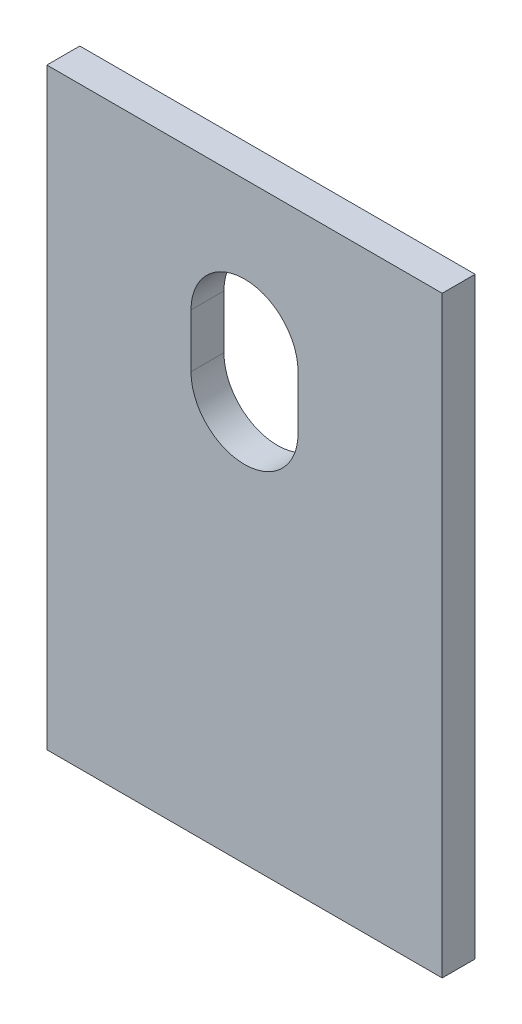
ISO-10303-21;
HEADER;
FILE_DESCRIPTION(('STEP AP214'),'2;1');
FILE_NAME('part.step','',(''),(''),'','','');
FILE_SCHEMA(('AUTOMOTIVE_DESIGN { 1 0 10303 214 1 1 1 1 }'));
ENDSEC;
DATA;
#1=APPLICATION_CONTEXT('core data for automotive mechanical design processes');
#2=APPLICATION_PROTOCOL_DEFINITION('international standard','automotive_design',2000,#1);
#3=PRODUCT_CONTEXT('',#1,'mechanical');
#4=PRODUCT('Part','Part','',(#3));
#5=PRODUCT_RELATED_PRODUCT_CATEGORY('part','',(#4));
#6=PRODUCT_DEFINITION_FORMATION('','',#4);
#7=PRODUCT_DEFINITION_CONTEXT('part definition',#1,'design');
#8=PRODUCT_DEFINITION('design','',#6,#7);
#9=PRODUCT_DEFINITION_SHAPE('','',#8);
#10=(LENGTH_UNIT() NAMED_UNIT(*) SI_UNIT(.MILLI.,.METRE.));
#11=(NAMED_UNIT(*) PLANE_ANGLE_UNIT() SI_UNIT($,.RADIAN.));
#12=(NAMED_UNIT(*) SI_UNIT($,.STERADIAN.) SOLID_ANGLE_UNIT());
#13=UNCERTAINTY_MEASURE_WITH_UNIT(LENGTH_MEASURE(1.E-05),#10,'distance_accuracy_value','');
#14=(GEOMETRIC_REPRESENTATION_CONTEXT(3) GLOBAL_UNCERTAINTY_ASSIGNED_CONTEXT((#13)) GLOBAL_UNIT_ASSIGNED_CONTEXT((#10,
#11,#12)) REPRESENTATION_CONTEXT('',''));
#15=CARTESIAN_POINT('',(0.,0.,0.));
#16=DIRECTION('',(0.,0.,1.));
#17=DIRECTION('',(1.,0.,0.));
#18=AXIS2_PLACEMENT_3D('',#15,#16,#17);
#19=CARTESIAN_POINT('',(0.,114.3,0.));
#20=DIRECTION('',(1.,0.,0.));
#21=DIRECTION('',(0.,0.,-1.));
#22=AXIS2_PLACEMENT_3D('',#19,#20,#21);
#23=PLANE('',#22);
#24=DIRECTION('',(0.,0.,1.));
#25=VECTOR('',#24,1.);
#26=CARTESIAN_POINT('',(0.,0.,0.));
#27=LINE('',#26,#25);
#28=CARTESIAN_POINT('',(0.,0.,-6.35));
#29=VERTEX_POINT('',#28);
#30=CARTESIAN_POINT('',(0.,0.,0.));
#31=VERTEX_POINT('',#30);
#32=EDGE_CURVE('E132',#29,#31,#27,.T.);
#33=ORIENTED_EDGE('',*,*,#32,.T.);
#34=DIRECTION('',(0.,-1.,0.));
#35=VECTOR('',#34,1.);
#36=CARTESIAN_POINT('',(0.,114.3,0.));
#37=LINE('',#36,#35);
#38=CARTESIAN_POINT('',(0.,114.3,0.));
#39=VERTEX_POINT('',#38);
#40=EDGE_CURVE('E11',#39,#31,#37,.T.);
#41=ORIENTED_EDGE('',*,*,#40,.F.);
#42=DIRECTION('',(0.,0.,1.));
#43=VECTOR('',#42,1.);
#44=CARTESIAN_POINT('',(0.,114.3,0.));
#45=LINE('',#44,#43);
#46=CARTESIAN_POINT('',(0.,114.3,-6.35));
#47=VERTEX_POINT('',#46);
#48=EDGE_CURVE('E136',#47,#39,#45,.T.);
#49=ORIENTED_EDGE('',*,*,#48,.F.);
#50=DIRECTION('',(0.,-1.,0.));
#51=VECTOR('',#50,1.);
#52=CARTESIAN_POINT('',(0.,114.3,-6.35));
#53=LINE('',#52,#51);
#54=EDGE_CURVE('E146',#47,#29,#53,.T.);
#55=ORIENTED_EDGE('',*,*,#54,.T.);
#56=EDGE_LOOP('',(#33,#41,#49,#55));
#57=FACE_BOUND('',#56,.T.);
#58=ADVANCED_FACE('F35',(#57),#23,.F.);
#59=CARTESIAN_POINT('',(0.,114.3,0.));
#60=DIRECTION('',(0.,0.,-1.));
#61=DIRECTION('',(-1.,0.,0.));
#62=AXIS2_PLACEMENT_3D('',#59,#60,#61);
#63=PLANE('',#62);
#64=DIRECTION('',(0.,-1.,0.));
#65=VECTOR('',#64,1.);
#66=CARTESIAN_POINT('',(27.78125,87.3125,0.));
#67=LINE('',#66,#65);
#68=CARTESIAN_POINT('',(27.78125,87.3125,0.));
#69=VERTEX_POINT('',#68);
#70=CARTESIAN_POINT('',(27.78125,76.99375,0.));
#71=VERTEX_POINT('',#70);
#72=EDGE_CURVE('E126',#69,#71,#67,.T.);
#73=ORIENTED_EDGE('',*,*,#72,.F.);
#74=CARTESIAN_POINT('',(38.1,87.3125,0.));
#75=DIRECTION('',(0.,0.,1.));
#76=DIRECTION('',(1.,0.,0.));
#77=AXIS2_PLACEMENT_3D('',#74,#75,#76);
#78=CIRCLE('',#77,10.31875);
#79=CARTESIAN_POINT('',(48.41875,87.3125,0.));
#80=VERTEX_POINT('',#79);
#81=EDGE_CURVE('E49',#80,#69,#78,.T.);
#82=ORIENTED_EDGE('',*,*,#81,.F.);
#83=DIRECTION('',(0.,1.,0.));
#84=VECTOR('',#83,1.);
#85=CARTESIAN_POINT('',(48.41875,87.3125,0.));
#86=LINE('',#85,#84);
#87=CARTESIAN_POINT('',(48.41875,76.99375,0.));
#88=VERTEX_POINT('',#87);
#89=EDGE_CURVE('E117',#88,#80,#86,.T.);
#90=ORIENTED_EDGE('',*,*,#89,.F.);
#91=CARTESIAN_POINT('',(38.1,76.99375,0.));
#92=DIRECTION('',(0.,0.,1.));
#93=DIRECTION('',(1.,0.,0.));
#94=AXIS2_PLACEMENT_3D('',#91,#92,#93);
#95=CIRCLE('',#94,10.31875);
#96=EDGE_CURVE('E120',#71,#88,#95,.T.);
#97=ORIENTED_EDGE('',*,*,#96,.F.);
#98=EDGE_LOOP('',(#73,#82,#90,#97));
#99=FACE_BOUND('',#98,.T.);
#100=DIRECTION('',(1.,0.,0.));
#101=VECTOR('',#100,1.);
#102=CARTESIAN_POINT('',(0.,0.,0.));
#103=LINE('',#102,#101);
#104=CARTESIAN_POINT('',(76.2,0.,0.));
#105=VERTEX_POINT('',#104);
#106=EDGE_CURVE('E149',#31,#105,#103,.T.);
#107=ORIENTED_EDGE('',*,*,#106,.T.);
#108=DIRECTION('',(0.,-1.,0.));
#109=VECTOR('',#108,1.);
#110=CARTESIAN_POINT('',(76.2,114.3,0.));
#111=LINE('',#110,#109);
#112=CARTESIAN_POINT('',(76.2,114.3,0.));
#113=VERTEX_POINT('',#112);
#114=EDGE_CURVE('E42',#113,#105,#111,.T.);
#115=ORIENTED_EDGE('',*,*,#114,.F.);
#116=DIRECTION('',(1.,0.,0.));
#117=VECTOR('',#116,1.);
#118=CARTESIAN_POINT('',(0.,114.3,0.));
#119=LINE('',#118,#117);
#120=EDGE_CURVE('E139',#39,#113,#119,.T.);
#121=ORIENTED_EDGE('',*,*,#120,.F.);
#122=ORIENTED_EDGE('',*,*,#40,.T.);
#123=EDGE_LOOP('',(#107,#115,#121,#122));
#124=FACE_BOUND('',#123,.T.);
#125=ADVANCED_FACE('F177',(#99,#124),#63,.F.);
#126=CARTESIAN_POINT('',(76.2,114.3,0.));
#127=DIRECTION('',(-1.,0.,0.));
#128=DIRECTION('',(0.,0.,1.));
#129=AXIS2_PLACEMENT_3D('',#126,#127,#128);
#130=PLANE('',#129);
#131=DIRECTION('',(0.,0.,-1.));
#132=VECTOR('',#131,1.);
#133=CARTESIAN_POINT('',(76.2,0.,0.));
#134=LINE('',#133,#132);
#135=CARTESIAN_POINT('',(76.2,0.,-6.35));
#136=VERTEX_POINT('',#135);
#137=EDGE_CURVE('E151',#105,#136,#134,.T.);
#138=ORIENTED_EDGE('',*,*,#137,.T.);
#139=DIRECTION('',(0.,-1.,0.));
#140=VECTOR('',#139,1.);
#141=CARTESIAN_POINT('',(76.2,114.3,-6.35));
#142=LINE('',#141,#140);
#143=CARTESIAN_POINT('',(76.2,114.3,-6.35));
#144=VERTEX_POINT('',#143);
#145=EDGE_CURVE('E156',#144,#136,#142,.T.);
#146=ORIENTED_EDGE('',*,*,#145,.F.);
#147=DIRECTION('',(0.,0.,-1.));
#148=VECTOR('',#147,1.);
#149=CARTESIAN_POINT('',(76.2,114.3,0.));
#150=LINE('',#149,#148);
#151=EDGE_CURVE('E142',#113,#144,#150,.T.);
#152=ORIENTED_EDGE('',*,*,#151,.F.);
#153=ORIENTED_EDGE('',*,*,#114,.T.);
#154=EDGE_LOOP('',(#138,#146,#152,#153));
#155=FACE_BOUND('',#154,.T.);
#156=ADVANCED_FACE('F163',(#155),#130,.F.);
#157=CARTESIAN_POINT('',(0.,114.3,-6.35));
#158=DIRECTION('',(0.,0.,1.));
#159=DIRECTION('',(1.,0.,0.));
#160=AXIS2_PLACEMENT_3D('',#157,#158,#159);
#161=PLANE('',#160);
#162=DIRECTION('',(0.,1.,0.));
#163=VECTOR('',#162,1.);
#164=CARTESIAN_POINT('',(48.41875,87.3125,-6.35));
#165=LINE('',#164,#163);
#166=CARTESIAN_POINT('',(48.41875,76.99375,-6.35));
#167=VERTEX_POINT('',#166);
#168=CARTESIAN_POINT('',(48.41875,87.3125,-6.35));
#169=VERTEX_POINT('',#168);
#170=EDGE_CURVE('E107',#167,#169,#165,.T.);
#171=ORIENTED_EDGE('',*,*,#170,.T.);
#172=CARTESIAN_POINT('',(38.1,87.3125,-6.35));
#173=DIRECTION('',(0.,0.,1.));
#174=DIRECTION('',(1.,0.,0.));
#175=AXIS2_PLACEMENT_3D('',#172,#173,#174);
#176=CIRCLE('',#175,10.31875);
#177=CARTESIAN_POINT('',(27.78125,87.3125,-6.35));
#178=VERTEX_POINT('',#177);
#179=EDGE_CURVE('E101',#169,#178,#176,.T.);
#180=ORIENTED_EDGE('',*,*,#179,.T.);
#181=DIRECTION('',(0.,-1.,0.));
#182=VECTOR('',#181,1.);
#183=CARTESIAN_POINT('',(27.78125,87.3125,-6.35));
#184=LINE('',#183,#182);
#185=CARTESIAN_POINT('',(27.78125,76.99375,-6.35));
#186=VERTEX_POINT('',#185);
#187=EDGE_CURVE('E110',#178,#186,#184,.T.);
#188=ORIENTED_EDGE('',*,*,#187,.T.);
#189=CARTESIAN_POINT('',(38.1,76.99375,-6.35));
#190=DIRECTION('',(0.,0.,1.));
#191=DIRECTION('',(1.,0.,0.));
#192=AXIS2_PLACEMENT_3D('',#189,#190,#191);
#193=CIRCLE('',#192,10.31875);
#194=EDGE_CURVE('E57',#186,#167,#193,.T.);
#195=ORIENTED_EDGE('',*,*,#194,.T.);
#196=EDGE_LOOP('',(#171,#180,#188,#195));
#197=FACE_BOUND('',#196,.T.);
#198=DIRECTION('',(-1.,0.,0.));
#199=VECTOR('',#198,1.);
#200=CARTESIAN_POINT('',(0.,0.,-6.35));
#201=LINE('',#200,#199);
#202=EDGE_CURVE('E140',#136,#29,#201,.T.);
#203=ORIENTED_EDGE('',*,*,#202,.T.);
#204=ORIENTED_EDGE('',*,*,#54,.F.);
#205=DIRECTION('',(-1.,0.,0.));
#206=VECTOR('',#205,1.);
#207=CARTESIAN_POINT('',(0.,114.3,-6.35));
#208=LINE('',#207,#206);
#209=EDGE_CURVE('E144',#144,#47,#208,.T.);
#210=ORIENTED_EDGE('',*,*,#209,.F.);
#211=ORIENTED_EDGE('',*,*,#145,.T.);
#212=EDGE_LOOP('',(#203,#204,#210,#211));
#213=FACE_BOUND('',#212,.T.);
#214=ADVANCED_FACE('F114',(#197,#213),#161,.F.);
#215=CARTESIAN_POINT('',(0.,114.3,0.));
#216=DIRECTION('',(0.,-1.,0.));
#217=DIRECTION('',(0.,0.,-1.));
#218=AXIS2_PLACEMENT_3D('',#215,#216,#217);
#219=PLANE('',#218);
#220=ORIENTED_EDGE('',*,*,#48,.T.);
#221=ORIENTED_EDGE('',*,*,#120,.T.);
#222=ORIENTED_EDGE('',*,*,#151,.T.);
#223=ORIENTED_EDGE('',*,*,#209,.T.);
#224=EDGE_LOOP('',(#220,#221,#222,#223));
#225=FACE_BOUND('',#224,.T.);
#226=ADVANCED_FACE('F176',(#225),#219,.F.);
#227=CARTESIAN_POINT('',(0.,0.,0.));
#228=DIRECTION('',(0.,-1.,0.));
#229=DIRECTION('',(0.,0.,-1.));
#230=AXIS2_PLACEMENT_3D('',#227,#228,#229);
#231=PLANE('',#230);
#232=ORIENTED_EDGE('',*,*,#32,.F.);
#233=ORIENTED_EDGE('',*,*,#202,.F.);
#234=ORIENTED_EDGE('',*,*,#137,.F.);
#235=ORIENTED_EDGE('',*,*,#106,.F.);
#236=EDGE_LOOP('',(#232,#233,#234,#235));
#237=FACE_BOUND('',#236,.T.);
#238=ADVANCED_FACE('F169',(#237),#231,.T.);
#239=CARTESIAN_POINT('',(38.1,87.3125,-6.35));
#240=DIRECTION('',(0.,0.,1.));
#241=DIRECTION('',(1.,0.,0.));
#242=AXIS2_PLACEMENT_3D('',#239,#240,#241);
#243=CYLINDRICAL_SURFACE('',#242,10.31875);
#244=ORIENTED_EDGE('',*,*,#81,.T.);
#245=DIRECTION('',(0.,0.,1.));
#246=VECTOR('',#245,1.);
#247=CARTESIAN_POINT('',(27.78125,87.3125,-6.35));
#248=LINE('',#247,#246);
#249=EDGE_CURVE('E97',#178,#69,#248,.T.);
#250=ORIENTED_EDGE('',*,*,#249,.F.);
#251=ORIENTED_EDGE('',*,*,#179,.F.);
#252=DIRECTION('',(0.,0.,1.));
#253=VECTOR('',#252,1.);
#254=CARTESIAN_POINT('',(48.41875,87.3125,-6.35));
#255=LINE('',#254,#253);
#256=EDGE_CURVE('E130',#169,#80,#255,.T.);
#257=ORIENTED_EDGE('',*,*,#256,.T.);
#258=EDGE_LOOP('',(#244,#250,#251,#257));
#259=FACE_BOUND('',#258,.T.);
#260=ADVANCED_FACE('F99',(#259),#243,.F.);
#261=CARTESIAN_POINT('',(48.41875,87.3125,-6.35));
#262=DIRECTION('',(1.,0.,0.));
#263=DIRECTION('',(0.,0.,-1.));
#264=AXIS2_PLACEMENT_3D('',#261,#262,#263);
#265=PLANE('',#264);
#266=ORIENTED_EDGE('',*,*,#89,.T.);
#267=ORIENTED_EDGE('',*,*,#256,.F.);
#268=ORIENTED_EDGE('',*,*,#170,.F.);
#269=DIRECTION('',(0.,0.,1.));
#270=VECTOR('',#269,1.);
#271=CARTESIAN_POINT('',(48.41875,76.99375,-6.35));
#272=LINE('',#271,#270);
#273=EDGE_CURVE('E133',#167,#88,#272,.T.);
#274=ORIENTED_EDGE('',*,*,#273,.T.);
#275=EDGE_LOOP('',(#266,#267,#268,#274));
#276=FACE_BOUND('',#275,.T.);
#277=ADVANCED_FACE('F194',(#276),#265,.F.);
#278=CARTESIAN_POINT('',(38.1,76.99375,-6.35));
#279=DIRECTION('',(0.,0.,1.));
#280=DIRECTION('',(1.,0.,0.));
#281=AXIS2_PLACEMENT_3D('',#278,#279,#280);
#282=CYLINDRICAL_SURFACE('',#281,10.31875);
#283=ORIENTED_EDGE('',*,*,#96,.T.);
#284=ORIENTED_EDGE('',*,*,#273,.F.);
#285=ORIENTED_EDGE('',*,*,#194,.F.);
#286=DIRECTION('',(0.,0.,1.));
#287=VECTOR('',#286,1.);
#288=CARTESIAN_POINT('',(27.78125,76.99375,-6.35));
#289=LINE('',#288,#287);
#290=EDGE_CURVE('E106',#186,#71,#289,.T.);
#291=ORIENTED_EDGE('',*,*,#290,.T.);
#292=EDGE_LOOP('',(#283,#284,#285,#291));
#293=FACE_BOUND('',#292,.T.);
#294=ADVANCED_FACE('F197',(#293),#282,.F.);
#295=CARTESIAN_POINT('',(27.78125,87.3125,-6.35));
#296=DIRECTION('',(-1.,0.,0.));
#297=DIRECTION('',(0.,-1.,0.));
#298=AXIS2_PLACEMENT_3D('',#295,#296,#297);
#299=PLANE('',#298);
#300=ORIENTED_EDGE('',*,*,#72,.T.);
#301=ORIENTED_EDGE('',*,*,#290,.F.);
#302=ORIENTED_EDGE('',*,*,#187,.F.);
#303=ORIENTED_EDGE('',*,*,#249,.T.);
#304=EDGE_LOOP('',(#300,#301,#302,#303));
#305=FACE_BOUND('',#304,.T.);
#306=ADVANCED_FACE('F111',(#305),#299,.F.);
#307=CLOSED_SHELL('',(#58,#125,#156,#214,#226,#238,#260,#277,#294,#306));
#308=MANIFOLD_SOLID_BREP('B2',#307);
#309=ADVANCED_BREP_SHAPE_REPRESENTATION('',(#18,#308),#14);
#310=SHAPE_DEFINITION_REPRESENTATION(#9,#309);
ENDSEC;
END-ISO-10303-21;
